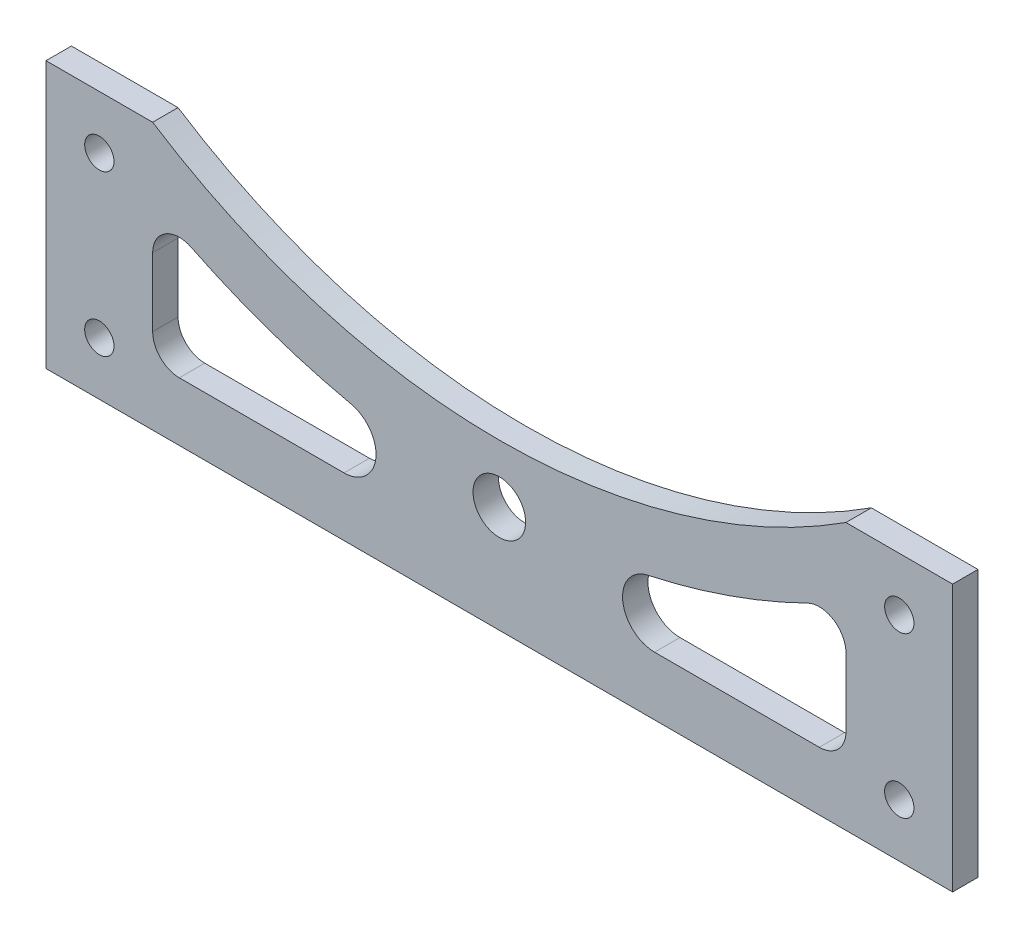
ISO-10303-21;
HEADER;
FILE_DESCRIPTION(('STEP AP214'),'2;1');
FILE_NAME('part.step','',(''),(''),'','','');
FILE_SCHEMA(('AUTOMOTIVE_DESIGN { 1 0 10303 214 1 1 1 1 }'));
ENDSEC;
DATA;
#1=APPLICATION_CONTEXT('core data for automotive mechanical design processes');
#2=APPLICATION_PROTOCOL_DEFINITION('international standard','automotive_design',2000,#1);
#3=PRODUCT_CONTEXT('',#1,'mechanical');
#4=PRODUCT('Part','Part','',(#3));
#5=PRODUCT_RELATED_PRODUCT_CATEGORY('part','',(#4));
#6=PRODUCT_DEFINITION_FORMATION('','',#4);
#7=PRODUCT_DEFINITION_CONTEXT('part definition',#1,'design');
#8=PRODUCT_DEFINITION('design','',#6,#7);
#9=PRODUCT_DEFINITION_SHAPE('','',#8);
#10=(LENGTH_UNIT() NAMED_UNIT(*) SI_UNIT(.MILLI.,.METRE.));
#11=(NAMED_UNIT(*) PLANE_ANGLE_UNIT() SI_UNIT($,.RADIAN.));
#12=(NAMED_UNIT(*) SI_UNIT($,.STERADIAN.) SOLID_ANGLE_UNIT());
#13=UNCERTAINTY_MEASURE_WITH_UNIT(LENGTH_MEASURE(1.E-05),#10,'distance_accuracy_value','');
#14=(GEOMETRIC_REPRESENTATION_CONTEXT(3) GLOBAL_UNCERTAINTY_ASSIGNED_CONTEXT((#13)) GLOBAL_UNIT_ASSIGNED_CONTEXT((#10,
#11,#12)) REPRESENTATION_CONTEXT('',''));
#15=CARTESIAN_POINT('',(0.,0.,0.));
#16=DIRECTION('',(0.,0.,1.));
#17=DIRECTION('',(1.,0.,0.));
#18=AXIS2_PLACEMENT_3D('',#15,#16,#17);
#19=CARTESIAN_POINT('',(0.,150.87120500916,4.7625));
#20=DIRECTION('',(0.,0.,1.));
#21=DIRECTION('',(1.,0.,0.));
#22=AXIS2_PLACEMENT_3D('',#19,#20,#21);
#23=PLANE('',#22);
#24=CARTESIAN_POINT('',(0.,150.87120500916,4.7625));
#25=DIRECTION('',(0.,0.,-1.));
#26=DIRECTION('',(1.,0.,0.));
#27=AXIS2_PLACEMENT_3D('',#24,#25,#26);
#28=CIRCLE('',#27,131.);
#29=CARTESIAN_POINT('',(-27.8368892894249,22.862972482153,4.7625));
#30=VERTEX_POINT('',#29);
#31=CARTESIAN_POINT('',(-57.7941176470588,33.309136443666,4.7625));
#32=VERTEX_POINT('',#31);
#33=EDGE_CURVE('E211',#30,#32,#28,.T.);
#34=ORIENTED_EDGE('',*,*,#33,.F.);
#35=CARTESIAN_POINT('',(-29.1118613179481,17.,4.7625));
#36=DIRECTION('',(0.,0.,1.));
#37=DIRECTION('',(1.,0.,0.));
#38=AXIS2_PLACEMENT_3D('',#35,#36,#37);
#39=CIRCLE('',#38,6.00000000000001);
#40=CARTESIAN_POINT('',(-29.1118613179481,11.,4.7625));
#41=VERTEX_POINT('',#40);
#42=EDGE_CURVE('E209',#41,#30,#39,.T.);
#43=ORIENTED_EDGE('',*,*,#42,.F.);
#44=DIRECTION('',(1.,0.,0.));
#45=VECTOR('',#44,1.);
#46=CARTESIAN_POINT('',(-60.,11.,4.7625));
#47=LINE('',#46,#45);
#48=CARTESIAN_POINT('',(-60.,11.,4.7625));
#49=VERTEX_POINT('',#48);
#50=EDGE_CURVE('E221',#49,#41,#47,.T.);
#51=ORIENTED_EDGE('',*,*,#50,.F.);
#52=CARTESIAN_POINT('',(-60.,16.,4.7625));
#53=DIRECTION('',(0.,0.,1.));
#54=DIRECTION('',(1.,0.,0.));
#55=AXIS2_PLACEMENT_3D('',#52,#53,#54);
#56=CIRCLE('',#55,5.);
#57=CARTESIAN_POINT('',(-65.,16.,4.7625));
#58=VERTEX_POINT('',#57);
#59=EDGE_CURVE('E218',#58,#49,#56,.T.);
#60=ORIENTED_EDGE('',*,*,#59,.F.);
#61=DIRECTION('',(0.,-1.,0.));
#62=VECTOR('',#61,1.);
#63=CARTESIAN_POINT('',(-65.,28.8220345900212,4.7625));
#64=LINE('',#63,#62);
#65=CARTESIAN_POINT('',(-65.,28.8220345900212,4.7625));
#66=VERTEX_POINT('',#65);
#67=EDGE_CURVE('E216',#66,#58,#64,.T.);
#68=ORIENTED_EDGE('',*,*,#67,.F.);
#69=CARTESIAN_POINT('',(-60.,28.8220345900212,4.7625));
#70=DIRECTION('',(0.,0.,1.));
#71=DIRECTION('',(1.,0.,0.));
#72=AXIS2_PLACEMENT_3D('',#69,#70,#71);
#73=CIRCLE('',#72,5.);
#74=EDGE_CURVE('E214',#32,#66,#73,.T.);
#75=ORIENTED_EDGE('',*,*,#74,.F.);
#76=EDGE_LOOP('',(#34,#43,#51,#60,#68,#75));
#77=FACE_BOUND('',#76,.T.);
#78=CARTESIAN_POINT('',(75.,40.,4.7625));
#79=DIRECTION('',(0.,0.,1.));
#80=DIRECTION('',(1.,0.,0.));
#81=AXIS2_PLACEMENT_3D('',#78,#79,#80);
#82=CIRCLE('',#81,2.75000000000001);
#83=CARTESIAN_POINT('',(77.75,40.,4.7625));
#84=VERTEX_POINT('',#83);
#85=EDGE_CURVE('E260',#84,#84,#82,.T.);
#86=ORIENTED_EDGE('',*,*,#85,.F.);
#87=EDGE_LOOP('',(#86));
#88=FACE_BOUND('',#87,.T.);
#89=CARTESIAN_POINT('',(-75.,40.,4.7625));
#90=DIRECTION('',(0.,0.,1.));
#91=DIRECTION('',(1.,0.,0.));
#92=AXIS2_PLACEMENT_3D('',#89,#90,#91);
#93=CIRCLE('',#92,2.75000000000001);
#94=CARTESIAN_POINT('',(-72.25,40.,4.7625));
#95=VERTEX_POINT('',#94);
#96=EDGE_CURVE('E272',#95,#95,#93,.T.);
#97=ORIENTED_EDGE('',*,*,#96,.F.);
#98=EDGE_LOOP('',(#97));
#99=FACE_BOUND('',#98,.T.);
#100=DIRECTION('',(0.,-1.,0.));
#101=VECTOR('',#100,1.);
#102=CARTESIAN_POINT('',(-85.,0.,4.7625));
#103=LINE('',#102,#101);
#104=CARTESIAN_POINT('',(-85.,50.,4.7625));
#105=VERTEX_POINT('',#104);
#106=CARTESIAN_POINT('',(-85.,0.,4.7625));
#107=VERTEX_POINT('',#106);
#108=EDGE_CURVE('E284',#105,#107,#103,.T.);
#109=ORIENTED_EDGE('',*,*,#108,.T.);
#110=DIRECTION('',(1.,0.,0.));
#111=VECTOR('',#110,1.);
#112=CARTESIAN_POINT('',(-85.,0.,4.7625));
#113=LINE('',#112,#111);
#114=CARTESIAN_POINT('',(85.,0.,4.7625));
#115=VERTEX_POINT('',#114);
#116=EDGE_CURVE('E287',#107,#115,#113,.T.);
#117=ORIENTED_EDGE('',*,*,#116,.T.);
#118=DIRECTION('',(0.,1.,0.));
#119=VECTOR('',#118,1.);
#120=CARTESIAN_POINT('',(85.,0.,4.7625));
#121=LINE('',#120,#119);
#122=CARTESIAN_POINT('',(85.,50.,4.7625));
#123=VERTEX_POINT('',#122);
#124=EDGE_CURVE('E290',#115,#123,#121,.T.);
#125=ORIENTED_EDGE('',*,*,#124,.T.);
#126=DIRECTION('',(-1.,0.,0.));
#127=VECTOR('',#126,1.);
#128=CARTESIAN_POINT('',(85.,50.,4.7625));
#129=LINE('',#128,#127);
#130=CARTESIAN_POINT('',(65.,50.,4.7625));
#131=VERTEX_POINT('',#130);
#132=EDGE_CURVE('E292',#123,#131,#129,.T.);
#133=ORIENTED_EDGE('',*,*,#132,.T.);
#134=CARTESIAN_POINT('',(0.,150.87120500916,4.7625));
#135=DIRECTION('',(0.,0.,-1.));
#136=DIRECTION('',(1.,0.,0.));
#137=AXIS2_PLACEMENT_3D('',#134,#135,#136);
#138=CIRCLE('',#137,120.);
#139=CARTESIAN_POINT('',(-65.,50.,4.7625));
#140=VERTEX_POINT('',#139);
#141=EDGE_CURVE('E294',#131,#140,#138,.T.);
#142=ORIENTED_EDGE('',*,*,#141,.T.);
#143=DIRECTION('',(-1.,0.,0.));
#144=VECTOR('',#143,1.);
#145=CARTESIAN_POINT('',(-85.,50.,4.7625));
#146=LINE('',#145,#144);
#147=EDGE_CURVE('E296',#140,#105,#146,.T.);
#148=ORIENTED_EDGE('',*,*,#147,.T.);
#149=EDGE_LOOP('',(#109,#117,#125,#133,#142,#148));
#150=FACE_BOUND('',#149,.T.);
#151=CARTESIAN_POINT('',(0.,20.,4.7625));
#152=DIRECTION('',(0.,0.,1.));
#153=DIRECTION('',(1.,0.,0.));
#154=AXIS2_PLACEMENT_3D('',#151,#152,#153);
#155=CIRCLE('',#154,4.93);
#156=CARTESIAN_POINT('',(4.93,20.,4.7625));
#157=VERTEX_POINT('',#156);
#158=EDGE_CURVE('E278',#157,#157,#155,.T.);
#159=ORIENTED_EDGE('',*,*,#158,.F.);
#160=EDGE_LOOP('',(#159));
#161=FACE_BOUND('',#160,.T.);
#162=CARTESIAN_POINT('',(-75.,10.,4.7625));
#163=DIRECTION('',(0.,0.,1.));
#164=DIRECTION('',(1.,0.,0.));
#165=AXIS2_PLACEMENT_3D('',#162,#163,#164);
#166=CIRCLE('',#165,2.75000000000001);
#167=CARTESIAN_POINT('',(-72.25,10.,4.7625));
#168=VERTEX_POINT('',#167);
#169=EDGE_CURVE('E266',#168,#168,#166,.T.);
#170=ORIENTED_EDGE('',*,*,#169,.F.);
#171=EDGE_LOOP('',(#170));
#172=FACE_BOUND('',#171,.T.);
#173=CARTESIAN_POINT('',(75.,10.,4.7625));
#174=DIRECTION('',(0.,0.,1.));
#175=DIRECTION('',(1.,0.,0.));
#176=AXIS2_PLACEMENT_3D('',#173,#174,#175);
#177=CIRCLE('',#176,2.75000000000001);
#178=CARTESIAN_POINT('',(77.75,10.,4.7625));
#179=VERTEX_POINT('',#178);
#180=EDGE_CURVE('E254',#179,#179,#177,.T.);
#181=ORIENTED_EDGE('',*,*,#180,.F.);
#182=EDGE_LOOP('',(#181));
#183=FACE_BOUND('',#182,.T.);
#184=DIRECTION('',(1.,0.,0.));
#185=VECTOR('',#184,1.);
#186=CARTESIAN_POINT('',(60.,11.,4.7625));
#187=LINE('',#186,#185);
#188=CARTESIAN_POINT('',(29.1118613179481,11.,4.7625));
#189=VERTEX_POINT('',#188);
#190=CARTESIAN_POINT('',(60.,11.,4.7625));
#191=VERTEX_POINT('',#190);
#192=EDGE_CURVE('E166',#189,#191,#187,.T.);
#193=ORIENTED_EDGE('',*,*,#192,.F.);
#194=CARTESIAN_POINT('',(29.1118613179481,17.,4.7625));
#195=DIRECTION('',(0.,0.,1.));
#196=DIRECTION('',(1.,0.,0.));
#197=AXIS2_PLACEMENT_3D('',#194,#195,#196);
#198=CIRCLE('',#197,6.00000000000001);
#199=CARTESIAN_POINT('',(27.8368892894249,22.862972482153,4.7625));
#200=VERTEX_POINT('',#199);
#201=EDGE_CURVE('E158',#200,#189,#198,.T.);
#202=ORIENTED_EDGE('',*,*,#201,.F.);
#203=CARTESIAN_POINT('',(0.,150.87120500916,4.7625));
#204=DIRECTION('',(0.,0.,-1.));
#205=DIRECTION('',(1.,0.,0.));
#206=AXIS2_PLACEMENT_3D('',#203,#204,#205);
#207=CIRCLE('',#206,131.);
#208=CARTESIAN_POINT('',(57.7941176470588,33.309136443666,4.7625));
#209=VERTEX_POINT('',#208);
#210=EDGE_CURVE('E187',#209,#200,#207,.T.);
#211=ORIENTED_EDGE('',*,*,#210,.F.);
#212=CARTESIAN_POINT('',(60.,28.8220345900212,4.7625));
#213=DIRECTION('',(0.,0.,1.));
#214=DIRECTION('',(1.,0.,0.));
#215=AXIS2_PLACEMENT_3D('',#212,#213,#214);
#216=CIRCLE('',#215,5.);
#217=CARTESIAN_POINT('',(65.,28.8220345900212,4.7625));
#218=VERTEX_POINT('',#217);
#219=EDGE_CURVE('E185',#218,#209,#216,.T.);
#220=ORIENTED_EDGE('',*,*,#219,.F.);
#221=DIRECTION('',(0.,1.,0.));
#222=VECTOR('',#221,1.);
#223=CARTESIAN_POINT('',(65.,28.8220345900212,4.7625));
#224=LINE('',#223,#222);
#225=CARTESIAN_POINT('',(65.,16.,4.7625));
#226=VERTEX_POINT('',#225);
#227=EDGE_CURVE('E181',#226,#218,#224,.T.);
#228=ORIENTED_EDGE('',*,*,#227,.F.);
#229=CARTESIAN_POINT('',(60.,16.,4.7625));
#230=DIRECTION('',(0.,0.,1.));
#231=DIRECTION('',(-1.,0.,0.));
#232=AXIS2_PLACEMENT_3D('',#229,#230,#231);
#233=CIRCLE('',#232,4.99999999999999);
#234=EDGE_CURVE('E179',#191,#226,#233,.T.);
#235=ORIENTED_EDGE('',*,*,#234,.F.);
#236=EDGE_LOOP('',(#193,#202,#211,#220,#228,#235));
#237=FACE_BOUND('',#236,.T.);
#238=ADVANCED_FACE('F33',(#77,#88,#99,#150,#161,#172,#183,#237),#23,.T.);
#239=CARTESIAN_POINT('',(0.,150.87120500916,0.));
#240=DIRECTION('',(0.,0.,1.));
#241=DIRECTION('',(1.,0.,0.));
#242=AXIS2_PLACEMENT_3D('',#239,#240,#241);
#243=PLANE('',#242);
#244=CARTESIAN_POINT('',(-29.1118613179481,17.,0.));
#245=DIRECTION('',(0.,0.,1.));
#246=DIRECTION('',(1.,0.,0.));
#247=AXIS2_PLACEMENT_3D('',#244,#245,#246);
#248=CIRCLE('',#247,6.00000000000001);
#249=CARTESIAN_POINT('',(-29.1118613179481,11.,0.));
#250=VERTEX_POINT('',#249);
#251=CARTESIAN_POINT('',(-27.8368892894249,22.862972482153,0.));
#252=VERTEX_POINT('',#251);
#253=EDGE_CURVE('E174',#250,#252,#248,.T.);
#254=ORIENTED_EDGE('',*,*,#253,.T.);
#255=CARTESIAN_POINT('',(0.,150.87120500916,0.));
#256=DIRECTION('',(0.,0.,-1.));
#257=DIRECTION('',(1.,0.,0.));
#258=AXIS2_PLACEMENT_3D('',#255,#256,#257);
#259=CIRCLE('',#258,131.);
#260=CARTESIAN_POINT('',(-57.7941176470588,33.309136443666,0.));
#261=VERTEX_POINT('',#260);
#262=EDGE_CURVE('E226',#252,#261,#259,.T.);
#263=ORIENTED_EDGE('',*,*,#262,.T.);
#264=CARTESIAN_POINT('',(-60.,28.8220345900212,0.));
#265=DIRECTION('',(0.,0.,1.));
#266=DIRECTION('',(1.,0.,0.));
#267=AXIS2_PLACEMENT_3D('',#264,#265,#266);
#268=CIRCLE('',#267,5.);
#269=CARTESIAN_POINT('',(-65.,28.8220345900212,0.));
#270=VERTEX_POINT('',#269);
#271=EDGE_CURVE('E229',#261,#270,#268,.T.);
#272=ORIENTED_EDGE('',*,*,#271,.T.);
#273=DIRECTION('',(0.,-1.,0.));
#274=VECTOR('',#273,1.);
#275=CARTESIAN_POINT('',(-65.,28.8220345900212,0.));
#276=LINE('',#275,#274);
#277=CARTESIAN_POINT('',(-65.,16.,0.));
#278=VERTEX_POINT('',#277);
#279=EDGE_CURVE('E232',#270,#278,#276,.T.);
#280=ORIENTED_EDGE('',*,*,#279,.T.);
#281=CARTESIAN_POINT('',(-60.,16.,0.));
#282=DIRECTION('',(0.,0.,1.));
#283=DIRECTION('',(1.,0.,0.));
#284=AXIS2_PLACEMENT_3D('',#281,#282,#283);
#285=CIRCLE('',#284,5.);
#286=CARTESIAN_POINT('',(-60.,11.,0.));
#287=VERTEX_POINT('',#286);
#288=EDGE_CURVE('E235',#278,#287,#285,.T.);
#289=ORIENTED_EDGE('',*,*,#288,.T.);
#290=DIRECTION('',(1.,0.,0.));
#291=VECTOR('',#290,1.);
#292=CARTESIAN_POINT('',(-60.,11.,0.));
#293=LINE('',#292,#291);
#294=EDGE_CURVE('E212',#287,#250,#293,.T.);
#295=ORIENTED_EDGE('',*,*,#294,.T.);
#296=EDGE_LOOP('',(#254,#263,#272,#280,#289,#295));
#297=FACE_BOUND('',#296,.T.);
#298=CARTESIAN_POINT('',(75.,40.,0.));
#299=DIRECTION('',(0.,0.,1.));
#300=DIRECTION('',(1.,0.,0.));
#301=AXIS2_PLACEMENT_3D('',#298,#299,#300);
#302=CIRCLE('',#301,2.75000000000001);
#303=CARTESIAN_POINT('',(77.75,40.,0.));
#304=VERTEX_POINT('',#303);
#305=EDGE_CURVE('E257',#304,#304,#302,.T.);
#306=ORIENTED_EDGE('',*,*,#305,.T.);
#307=EDGE_LOOP('',(#306));
#308=FACE_BOUND('',#307,.T.);
#309=CARTESIAN_POINT('',(-75.,40.,0.));
#310=DIRECTION('',(0.,0.,1.));
#311=DIRECTION('',(1.,0.,0.));
#312=AXIS2_PLACEMENT_3D('',#309,#310,#311);
#313=CIRCLE('',#312,2.75000000000001);
#314=CARTESIAN_POINT('',(-72.25,40.,0.));
#315=VERTEX_POINT('',#314);
#316=EDGE_CURVE('E269',#315,#315,#313,.T.);
#317=ORIENTED_EDGE('',*,*,#316,.T.);
#318=EDGE_LOOP('',(#317));
#319=FACE_BOUND('',#318,.T.);
#320=DIRECTION('',(0.,-1.,0.));
#321=VECTOR('',#320,1.);
#322=CARTESIAN_POINT('',(-85.,0.,0.));
#323=LINE('',#322,#321);
#324=CARTESIAN_POINT('',(-85.,50.,0.));
#325=VERTEX_POINT('',#324);
#326=CARTESIAN_POINT('',(-85.,0.,0.));
#327=VERTEX_POINT('',#326);
#328=EDGE_CURVE('E281',#325,#327,#323,.T.);
#329=ORIENTED_EDGE('',*,*,#328,.F.);
#330=DIRECTION('',(-1.,0.,0.));
#331=VECTOR('',#330,1.);
#332=CARTESIAN_POINT('',(-85.,50.,0.));
#333=LINE('',#332,#331);
#334=CARTESIAN_POINT('',(-65.,50.,0.));
#335=VERTEX_POINT('',#334);
#336=EDGE_CURVE('E288',#335,#325,#333,.T.);
#337=ORIENTED_EDGE('',*,*,#336,.F.);
#338=CARTESIAN_POINT('',(0.,150.87120500916,0.));
#339=DIRECTION('',(0.,0.,-1.));
#340=DIRECTION('',(1.,0.,0.));
#341=AXIS2_PLACEMENT_3D('',#338,#339,#340);
#342=CIRCLE('',#341,120.);
#343=CARTESIAN_POINT('',(65.,50.,0.));
#344=VERTEX_POINT('',#343);
#345=EDGE_CURVE('E307',#344,#335,#342,.T.);
#346=ORIENTED_EDGE('',*,*,#345,.F.);
#347=DIRECTION('',(-1.,0.,0.));
#348=VECTOR('',#347,1.);
#349=CARTESIAN_POINT('',(85.,50.,0.));
#350=LINE('',#349,#348);
#351=CARTESIAN_POINT('',(85.,50.,0.));
#352=VERTEX_POINT('',#351);
#353=EDGE_CURVE('E305',#352,#344,#350,.T.);
#354=ORIENTED_EDGE('',*,*,#353,.F.);
#355=DIRECTION('',(0.,1.,0.));
#356=VECTOR('',#355,1.);
#357=CARTESIAN_POINT('',(85.,0.,0.));
#358=LINE('',#357,#356);
#359=CARTESIAN_POINT('',(85.,0.,0.));
#360=VERTEX_POINT('',#359);
#361=EDGE_CURVE('E303',#360,#352,#358,.T.);
#362=ORIENTED_EDGE('',*,*,#361,.F.);
#363=DIRECTION('',(1.,0.,0.));
#364=VECTOR('',#363,1.);
#365=CARTESIAN_POINT('',(-85.,0.,0.));
#366=LINE('',#365,#364);
#367=EDGE_CURVE('E301',#327,#360,#366,.T.);
#368=ORIENTED_EDGE('',*,*,#367,.F.);
#369=EDGE_LOOP('',(#329,#337,#346,#354,#362,#368));
#370=FACE_BOUND('',#369,.T.);
#371=CARTESIAN_POINT('',(0.,20.,0.));
#372=DIRECTION('',(0.,0.,1.));
#373=DIRECTION('',(1.,0.,0.));
#374=AXIS2_PLACEMENT_3D('',#371,#372,#373);
#375=CIRCLE('',#374,4.93);
#376=CARTESIAN_POINT('',(4.93,20.,0.));
#377=VERTEX_POINT('',#376);
#378=EDGE_CURVE('E275',#377,#377,#375,.T.);
#379=ORIENTED_EDGE('',*,*,#378,.T.);
#380=EDGE_LOOP('',(#379));
#381=FACE_BOUND('',#380,.T.);
#382=CARTESIAN_POINT('',(-75.,10.,0.));
#383=DIRECTION('',(0.,0.,1.));
#384=DIRECTION('',(1.,0.,0.));
#385=AXIS2_PLACEMENT_3D('',#382,#383,#384);
#386=CIRCLE('',#385,2.75000000000001);
#387=CARTESIAN_POINT('',(-72.25,10.,0.));
#388=VERTEX_POINT('',#387);
#389=EDGE_CURVE('E263',#388,#388,#386,.T.);
#390=ORIENTED_EDGE('',*,*,#389,.T.);
#391=EDGE_LOOP('',(#390));
#392=FACE_BOUND('',#391,.T.);
#393=CARTESIAN_POINT('',(75.,10.,0.));
#394=DIRECTION('',(0.,0.,1.));
#395=DIRECTION('',(1.,0.,0.));
#396=AXIS2_PLACEMENT_3D('',#393,#394,#395);
#397=CIRCLE('',#396,2.75000000000001);
#398=CARTESIAN_POINT('',(77.75,10.,0.));
#399=VERTEX_POINT('',#398);
#400=EDGE_CURVE('E253',#399,#399,#397,.T.);
#401=ORIENTED_EDGE('',*,*,#400,.T.);
#402=EDGE_LOOP('',(#401));
#403=FACE_BOUND('',#402,.T.);
#404=CARTESIAN_POINT('',(29.1118613179481,17.,0.));
#405=DIRECTION('',(0.,0.,1.));
#406=DIRECTION('',(1.,0.,0.));
#407=AXIS2_PLACEMENT_3D('',#404,#405,#406);
#408=CIRCLE('',#407,6.00000000000001);
#409=CARTESIAN_POINT('',(27.8368892894249,22.862972482153,0.));
#410=VERTEX_POINT('',#409);
#411=CARTESIAN_POINT('',(29.1118613179481,11.,0.));
#412=VERTEX_POINT('',#411);
#413=EDGE_CURVE('E56',#410,#412,#408,.T.);
#414=ORIENTED_EDGE('',*,*,#413,.T.);
#415=DIRECTION('',(1.,0.,0.));
#416=VECTOR('',#415,1.);
#417=CARTESIAN_POINT('',(60.,11.,0.));
#418=LINE('',#417,#416);
#419=CARTESIAN_POINT('',(60.,11.,0.));
#420=VERTEX_POINT('',#419);
#421=EDGE_CURVE('E173',#412,#420,#418,.T.);
#422=ORIENTED_EDGE('',*,*,#421,.T.);
#423=CARTESIAN_POINT('',(60.,16.,0.));
#424=DIRECTION('',(0.,0.,1.));
#425=DIRECTION('',(-1.,0.,0.));
#426=AXIS2_PLACEMENT_3D('',#423,#424,#425);
#427=CIRCLE('',#426,4.99999999999999);
#428=CARTESIAN_POINT('',(65.,16.,0.));
#429=VERTEX_POINT('',#428);
#430=EDGE_CURVE('E191',#420,#429,#427,.T.);
#431=ORIENTED_EDGE('',*,*,#430,.T.);
#432=DIRECTION('',(0.,1.,0.));
#433=VECTOR('',#432,1.);
#434=CARTESIAN_POINT('',(65.,28.8220345900212,0.));
#435=LINE('',#434,#433);
#436=CARTESIAN_POINT('',(65.,28.8220345900212,0.));
#437=VERTEX_POINT('',#436);
#438=EDGE_CURVE('E194',#429,#437,#435,.T.);
#439=ORIENTED_EDGE('',*,*,#438,.T.);
#440=CARTESIAN_POINT('',(60.,28.8220345900212,0.));
#441=DIRECTION('',(0.,0.,1.));
#442=DIRECTION('',(1.,0.,0.));
#443=AXIS2_PLACEMENT_3D('',#440,#441,#442);
#444=CIRCLE('',#443,5.);
#445=CARTESIAN_POINT('',(57.7941176470588,33.309136443666,0.));
#446=VERTEX_POINT('',#445);
#447=EDGE_CURVE('E197',#437,#446,#444,.T.);
#448=ORIENTED_EDGE('',*,*,#447,.T.);
#449=CARTESIAN_POINT('',(0.,150.87120500916,0.));
#450=DIRECTION('',(0.,0.,-1.));
#451=DIRECTION('',(1.,0.,0.));
#452=AXIS2_PLACEMENT_3D('',#449,#450,#451);
#453=CIRCLE('',#452,131.);
#454=EDGE_CURVE('E167',#446,#410,#453,.T.);
#455=ORIENTED_EDGE('',*,*,#454,.T.);
#456=EDGE_LOOP('',(#414,#422,#431,#439,#448,#455));
#457=FACE_BOUND('',#456,.T.);
#458=ADVANCED_FACE('F331',(#297,#308,#319,#370,#381,#392,#403,#457),#243,.F.);
#459=CARTESIAN_POINT('',(-85.,0.,4.7625));
#460=DIRECTION('',(1.,0.,0.));
#461=DIRECTION('',(0.,0.,-1.));
#462=AXIS2_PLACEMENT_3D('',#459,#460,#461);
#463=PLANE('',#462);
#464=ORIENTED_EDGE('',*,*,#328,.T.);
#465=DIRECTION('',(0.,0.,-1.));
#466=VECTOR('',#465,1.);
#467=CARTESIAN_POINT('',(-85.,0.,4.7625));
#468=LINE('',#467,#466);
#469=EDGE_CURVE('E11',#107,#327,#468,.T.);
#470=ORIENTED_EDGE('',*,*,#469,.F.);
#471=ORIENTED_EDGE('',*,*,#108,.F.);
#472=DIRECTION('',(0.,0.,-1.));
#473=VECTOR('',#472,1.);
#474=CARTESIAN_POINT('',(-85.,50.,4.7625));
#475=LINE('',#474,#473);
#476=EDGE_CURVE('E298',#105,#325,#475,.T.);
#477=ORIENTED_EDGE('',*,*,#476,.T.);
#478=EDGE_LOOP('',(#464,#470,#471,#477));
#479=FACE_BOUND('',#478,.T.);
#480=ADVANCED_FACE('F35',(#479),#463,.F.);
#481=CARTESIAN_POINT('',(-85.,0.,4.7625));
#482=DIRECTION('',(0.,1.,0.));
#483=DIRECTION('',(0.,0.,1.));
#484=AXIS2_PLACEMENT_3D('',#481,#482,#483);
#485=PLANE('',#484);
#486=ORIENTED_EDGE('',*,*,#367,.T.);
#487=DIRECTION('',(0.,0.,-1.));
#488=VECTOR('',#487,1.);
#489=CARTESIAN_POINT('',(85.,0.,4.7625));
#490=LINE('',#489,#488);
#491=EDGE_CURVE('E41',#115,#360,#490,.T.);
#492=ORIENTED_EDGE('',*,*,#491,.F.);
#493=ORIENTED_EDGE('',*,*,#116,.F.);
#494=ORIENTED_EDGE('',*,*,#469,.T.);
#495=EDGE_LOOP('',(#486,#492,#493,#494));
#496=FACE_BOUND('',#495,.T.);
#497=ADVANCED_FACE('F349',(#496),#485,.F.);
#498=CARTESIAN_POINT('',(85.,0.,4.7625));
#499=DIRECTION('',(-1.,0.,0.));
#500=DIRECTION('',(0.,0.,1.));
#501=AXIS2_PLACEMENT_3D('',#498,#499,#500);
#502=PLANE('',#501);
#503=ORIENTED_EDGE('',*,*,#361,.T.);
#504=DIRECTION('',(0.,0.,-1.));
#505=VECTOR('',#504,1.);
#506=CARTESIAN_POINT('',(85.,50.,4.7625));
#507=LINE('',#506,#505);
#508=EDGE_CURVE('E318',#123,#352,#507,.T.);
#509=ORIENTED_EDGE('',*,*,#508,.F.);
#510=ORIENTED_EDGE('',*,*,#124,.F.);
#511=ORIENTED_EDGE('',*,*,#491,.T.);
#512=EDGE_LOOP('',(#503,#509,#510,#511));
#513=FACE_BOUND('',#512,.T.);
#514=ADVANCED_FACE('F325',(#513),#502,.F.);
#515=CARTESIAN_POINT('',(85.,50.,4.7625));
#516=DIRECTION('',(0.,-1.,0.));
#517=DIRECTION('',(0.,0.,-1.));
#518=AXIS2_PLACEMENT_3D('',#515,#516,#517);
#519=PLANE('',#518);
#520=ORIENTED_EDGE('',*,*,#353,.T.);
#521=DIRECTION('',(0.,0.,-1.));
#522=VECTOR('',#521,1.);
#523=CARTESIAN_POINT('',(65.,50.,4.7625));
#524=LINE('',#523,#522);
#525=EDGE_CURVE('E315',#131,#344,#524,.T.);
#526=ORIENTED_EDGE('',*,*,#525,.F.);
#527=ORIENTED_EDGE('',*,*,#132,.F.);
#528=ORIENTED_EDGE('',*,*,#508,.T.);
#529=EDGE_LOOP('',(#520,#526,#527,#528));
#530=FACE_BOUND('',#529,.T.);
#531=ADVANCED_FACE('F337',(#530),#519,.F.);
#532=CARTESIAN_POINT('',(0.,150.87120500916,4.7625));
#533=DIRECTION('',(0.,0.,-1.));
#534=DIRECTION('',(-1.,0.,0.));
#535=AXIS2_PLACEMENT_3D('',#532,#533,#534);
#536=CYLINDRICAL_SURFACE('',#535,120.);
#537=ORIENTED_EDGE('',*,*,#345,.T.);
#538=DIRECTION('',(0.,0.,-1.));
#539=VECTOR('',#538,1.);
#540=CARTESIAN_POINT('',(-65.,50.,4.7625));
#541=LINE('',#540,#539);
#542=EDGE_CURVE('E312',#140,#335,#541,.T.);
#543=ORIENTED_EDGE('',*,*,#542,.F.);
#544=ORIENTED_EDGE('',*,*,#141,.F.);
#545=ORIENTED_EDGE('',*,*,#525,.T.);
#546=EDGE_LOOP('',(#537,#543,#544,#545));
#547=FACE_BOUND('',#546,.T.);
#548=ADVANCED_FACE('F341',(#547),#536,.F.);
#549=CARTESIAN_POINT('',(-85.,50.,4.7625));
#550=DIRECTION('',(0.,-1.,0.));
#551=DIRECTION('',(0.,0.,-1.));
#552=AXIS2_PLACEMENT_3D('',#549,#550,#551);
#553=PLANE('',#552);
#554=ORIENTED_EDGE('',*,*,#336,.T.);
#555=ORIENTED_EDGE('',*,*,#476,.F.);
#556=ORIENTED_EDGE('',*,*,#147,.F.);
#557=ORIENTED_EDGE('',*,*,#542,.T.);
#558=EDGE_LOOP('',(#554,#555,#556,#557));
#559=FACE_BOUND('',#558,.T.);
#560=ADVANCED_FACE('F352',(#559),#553,.F.);
#561=CARTESIAN_POINT('',(0.,20.,4.7625));
#562=DIRECTION('',(0.,0.,-1.));
#563=DIRECTION('',(-1.,0.,0.));
#564=AXIS2_PLACEMENT_3D('',#561,#562,#563);
#565=CYLINDRICAL_SURFACE('',#564,4.93);
#566=ORIENTED_EDGE('',*,*,#158,.T.);
#567=EDGE_LOOP('',(#566));
#568=FACE_BOUND('',#567,.T.);
#569=ORIENTED_EDGE('',*,*,#378,.F.);
#570=EDGE_LOOP('',(#569));
#571=FACE_BOUND('',#570,.T.);
#572=ADVANCED_FACE('F354',(#568,#571),#565,.F.);
#573=CARTESIAN_POINT('',(-75.,40.,4.7625));
#574=DIRECTION('',(0.,0.,-1.));
#575=DIRECTION('',(-1.,0.,0.));
#576=AXIS2_PLACEMENT_3D('',#573,#574,#575);
#577=CYLINDRICAL_SURFACE('',#576,2.75000000000001);
#578=ORIENTED_EDGE('',*,*,#96,.T.);
#579=EDGE_LOOP('',(#578));
#580=FACE_BOUND('',#579,.T.);
#581=ORIENTED_EDGE('',*,*,#316,.F.);
#582=EDGE_LOOP('',(#581));
#583=FACE_BOUND('',#582,.T.);
#584=ADVANCED_FACE('F360',(#580,#583),#577,.F.);
#585=CARTESIAN_POINT('',(-75.,10.,4.7625));
#586=DIRECTION('',(0.,0.,-1.));
#587=DIRECTION('',(-1.,0.,0.));
#588=AXIS2_PLACEMENT_3D('',#585,#586,#587);
#589=CYLINDRICAL_SURFACE('',#588,2.75000000000001);
#590=ORIENTED_EDGE('',*,*,#169,.T.);
#591=EDGE_LOOP('',(#590));
#592=FACE_BOUND('',#591,.T.);
#593=ORIENTED_EDGE('',*,*,#389,.F.);
#594=EDGE_LOOP('',(#593));
#595=FACE_BOUND('',#594,.T.);
#596=ADVANCED_FACE('F377',(#592,#595),#589,.F.);
#597=CARTESIAN_POINT('',(75.,40.,4.7625));
#598=DIRECTION('',(0.,0.,-1.));
#599=DIRECTION('',(-1.,0.,0.));
#600=AXIS2_PLACEMENT_3D('',#597,#598,#599);
#601=CYLINDRICAL_SURFACE('',#600,2.75000000000001);
#602=ORIENTED_EDGE('',*,*,#85,.T.);
#603=EDGE_LOOP('',(#602));
#604=FACE_BOUND('',#603,.T.);
#605=ORIENTED_EDGE('',*,*,#305,.F.);
#606=EDGE_LOOP('',(#605));
#607=FACE_BOUND('',#606,.T.);
#608=ADVANCED_FACE('F381',(#604,#607),#601,.F.);
#609=CARTESIAN_POINT('',(75.,10.,4.7625));
#610=DIRECTION('',(0.,0.,-1.));
#611=DIRECTION('',(-1.,0.,0.));
#612=AXIS2_PLACEMENT_3D('',#609,#610,#611);
#613=CYLINDRICAL_SURFACE('',#612,2.75000000000001);
#614=ORIENTED_EDGE('',*,*,#180,.T.);
#615=EDGE_LOOP('',(#614));
#616=FACE_BOUND('',#615,.T.);
#617=ORIENTED_EDGE('',*,*,#400,.F.);
#618=EDGE_LOOP('',(#617));
#619=FACE_BOUND('',#618,.T.);
#620=ADVANCED_FACE('F385',(#616,#619),#613,.F.);
#621=CARTESIAN_POINT('',(-29.1118613179481,17.,4.7625));
#622=DIRECTION('',(0.,0.,-1.));
#623=DIRECTION('',(-1.,0.,0.));
#624=AXIS2_PLACEMENT_3D('',#621,#622,#623);
#625=CYLINDRICAL_SURFACE('',#624,6.00000000000001);
#626=ORIENTED_EDGE('',*,*,#253,.F.);
#627=DIRECTION('',(0.,0.,-1.));
#628=VECTOR('',#627,1.);
#629=CARTESIAN_POINT('',(-29.1118613179481,11.,4.7625));
#630=LINE('',#629,#628);
#631=EDGE_CURVE('E223',#41,#250,#630,.T.);
#632=ORIENTED_EDGE('',*,*,#631,.F.);
#633=ORIENTED_EDGE('',*,*,#42,.T.);
#634=DIRECTION('',(0.,0.,-1.));
#635=VECTOR('',#634,1.);
#636=CARTESIAN_POINT('',(-27.8368892894249,22.862972482153,4.7625));
#637=LINE('',#636,#635);
#638=EDGE_CURVE('E250',#30,#252,#637,.T.);
#639=ORIENTED_EDGE('',*,*,#638,.T.);
#640=EDGE_LOOP('',(#626,#632,#633,#639));
#641=FACE_BOUND('',#640,.T.);
#642=ADVANCED_FACE('F389',(#641),#625,.F.);
#643=CARTESIAN_POINT('',(0.,150.87120500916,4.7625));
#644=DIRECTION('',(0.,0.,-1.));
#645=DIRECTION('',(-1.,0.,0.));
#646=AXIS2_PLACEMENT_3D('',#643,#644,#645);
#647=CYLINDRICAL_SURFACE('',#646,131.);
#648=ORIENTED_EDGE('',*,*,#262,.F.);
#649=ORIENTED_EDGE('',*,*,#638,.F.);
#650=ORIENTED_EDGE('',*,*,#33,.T.);
#651=DIRECTION('',(0.,0.,-1.));
#652=VECTOR('',#651,1.);
#653=CARTESIAN_POINT('',(-57.7941176470588,33.309136443666,4.7625));
#654=LINE('',#653,#652);
#655=EDGE_CURVE('E248',#32,#261,#654,.T.);
#656=ORIENTED_EDGE('',*,*,#655,.T.);
#657=EDGE_LOOP('',(#648,#649,#650,#656));
#658=FACE_BOUND('',#657,.T.);
#659=ADVANCED_FACE('F393',(#658),#647,.T.);
#660=CARTESIAN_POINT('',(-60.,28.8220345900212,4.7625));
#661=DIRECTION('',(0.,0.,-1.));
#662=DIRECTION('',(-1.,0.,0.));
#663=AXIS2_PLACEMENT_3D('',#660,#661,#662);
#664=CYLINDRICAL_SURFACE('',#663,5.);
#665=ORIENTED_EDGE('',*,*,#271,.F.);
#666=ORIENTED_EDGE('',*,*,#655,.F.);
#667=ORIENTED_EDGE('',*,*,#74,.T.);
#668=DIRECTION('',(0.,0.,-1.));
#669=VECTOR('',#668,1.);
#670=CARTESIAN_POINT('',(-65.,28.8220345900212,4.7625));
#671=LINE('',#670,#669);
#672=EDGE_CURVE('E246',#66,#270,#671,.T.);
#673=ORIENTED_EDGE('',*,*,#672,.T.);
#674=EDGE_LOOP('',(#665,#666,#667,#673));
#675=FACE_BOUND('',#674,.T.);
#676=ADVANCED_FACE('F397',(#675),#664,.F.);
#677=CARTESIAN_POINT('',(-65.,28.8220345900212,4.7625));
#678=DIRECTION('',(1.,0.,0.));
#679=DIRECTION('',(0.,1.,0.));
#680=AXIS2_PLACEMENT_3D('',#677,#678,#679);
#681=PLANE('',#680);
#682=ORIENTED_EDGE('',*,*,#279,.F.);
#683=ORIENTED_EDGE('',*,*,#672,.F.);
#684=ORIENTED_EDGE('',*,*,#67,.T.);
#685=DIRECTION('',(0.,0.,-1.));
#686=VECTOR('',#685,1.);
#687=CARTESIAN_POINT('',(-65.,16.,4.7625));
#688=LINE('',#687,#686);
#689=EDGE_CURVE('E244',#58,#278,#688,.T.);
#690=ORIENTED_EDGE('',*,*,#689,.T.);
#691=EDGE_LOOP('',(#682,#683,#684,#690));
#692=FACE_BOUND('',#691,.T.);
#693=ADVANCED_FACE('F401',(#692),#681,.T.);
#694=CARTESIAN_POINT('',(-60.,16.,4.7625));
#695=DIRECTION('',(0.,0.,-1.));
#696=DIRECTION('',(-1.,0.,0.));
#697=AXIS2_PLACEMENT_3D('',#694,#695,#696);
#698=CYLINDRICAL_SURFACE('',#697,5.);
#699=ORIENTED_EDGE('',*,*,#288,.F.);
#700=ORIENTED_EDGE('',*,*,#689,.F.);
#701=ORIENTED_EDGE('',*,*,#59,.T.);
#702=DIRECTION('',(0.,0.,-1.));
#703=VECTOR('',#702,1.);
#704=CARTESIAN_POINT('',(-60.,11.,4.7625));
#705=LINE('',#704,#703);
#706=EDGE_CURVE('E242',#49,#287,#705,.T.);
#707=ORIENTED_EDGE('',*,*,#706,.T.);
#708=EDGE_LOOP('',(#699,#700,#701,#707));
#709=FACE_BOUND('',#708,.T.);
#710=ADVANCED_FACE('F405',(#709),#698,.F.);
#711=CARTESIAN_POINT('',(-60.,11.,4.7625));
#712=DIRECTION('',(0.,1.,0.));
#713=DIRECTION('',(-1.,0.,0.));
#714=AXIS2_PLACEMENT_3D('',#711,#712,#713);
#715=PLANE('',#714);
#716=ORIENTED_EDGE('',*,*,#294,.F.);
#717=ORIENTED_EDGE('',*,*,#706,.F.);
#718=ORIENTED_EDGE('',*,*,#50,.T.);
#719=ORIENTED_EDGE('',*,*,#631,.T.);
#720=EDGE_LOOP('',(#716,#717,#718,#719));
#721=FACE_BOUND('',#720,.T.);
#722=ADVANCED_FACE('F409',(#721),#715,.T.);
#723=CARTESIAN_POINT('',(29.1118613179481,17.,4.7625));
#724=DIRECTION('',(0.,0.,-1.));
#725=DIRECTION('',(-1.,0.,0.));
#726=AXIS2_PLACEMENT_3D('',#723,#724,#725);
#727=CYLINDRICAL_SURFACE('',#726,6.00000000000001);
#728=ORIENTED_EDGE('',*,*,#413,.F.);
#729=DIRECTION('',(0.,0.,-1.));
#730=VECTOR('',#729,1.);
#731=CARTESIAN_POINT('',(27.8368892894249,22.862972482153,4.7625));
#732=LINE('',#731,#730);
#733=EDGE_CURVE('E162',#200,#410,#732,.T.);
#734=ORIENTED_EDGE('',*,*,#733,.F.);
#735=ORIENTED_EDGE('',*,*,#201,.T.);
#736=DIRECTION('',(0.,0.,-1.));
#737=VECTOR('',#736,1.);
#738=CARTESIAN_POINT('',(29.1118613179481,11.,4.7625));
#739=LINE('',#738,#737);
#740=EDGE_CURVE('E161',#189,#412,#739,.T.);
#741=ORIENTED_EDGE('',*,*,#740,.T.);
#742=EDGE_LOOP('',(#728,#734,#735,#741));
#743=FACE_BOUND('',#742,.T.);
#744=ADVANCED_FACE('F160',(#743),#727,.F.);
#745=CARTESIAN_POINT('',(60.,11.,4.7625));
#746=DIRECTION('',(0.,1.,0.));
#747=DIRECTION('',(-1.,0.,0.));
#748=AXIS2_PLACEMENT_3D('',#745,#746,#747);
#749=PLANE('',#748);
#750=ORIENTED_EDGE('',*,*,#421,.F.);
#751=ORIENTED_EDGE('',*,*,#740,.F.);
#752=ORIENTED_EDGE('',*,*,#192,.T.);
#753=DIRECTION('',(0.,0.,-1.));
#754=VECTOR('',#753,1.);
#755=CARTESIAN_POINT('',(60.,11.,4.7625));
#756=LINE('',#755,#754);
#757=EDGE_CURVE('E175',#191,#420,#756,.T.);
#758=ORIENTED_EDGE('',*,*,#757,.T.);
#759=EDGE_LOOP('',(#750,#751,#752,#758));
#760=FACE_BOUND('',#759,.T.);
#761=ADVANCED_FACE('F170',(#760),#749,.T.);
#762=CARTESIAN_POINT('',(60.,16.,4.7625));
#763=DIRECTION('',(0.,0.,-1.));
#764=DIRECTION('',(-1.,0.,0.));
#765=AXIS2_PLACEMENT_3D('',#762,#763,#764);
#766=CYLINDRICAL_SURFACE('',#765,4.99999999999999);
#767=ORIENTED_EDGE('',*,*,#430,.F.);
#768=ORIENTED_EDGE('',*,*,#757,.F.);
#769=ORIENTED_EDGE('',*,*,#234,.T.);
#770=DIRECTION('',(0.,0.,-1.));
#771=VECTOR('',#770,1.);
#772=CARTESIAN_POINT('',(65.,16.,4.7625));
#773=LINE('',#772,#771);
#774=EDGE_CURVE('E206',#226,#429,#773,.T.);
#775=ORIENTED_EDGE('',*,*,#774,.T.);
#776=EDGE_LOOP('',(#767,#768,#769,#775));
#777=FACE_BOUND('',#776,.T.);
#778=ADVANCED_FACE('F418',(#777),#766,.F.);
#779=CARTESIAN_POINT('',(65.,28.8220345900212,4.7625));
#780=DIRECTION('',(-1.,0.,0.));
#781=DIRECTION('',(0.,-1.,0.));
#782=AXIS2_PLACEMENT_3D('',#779,#780,#781);
#783=PLANE('',#782);
#784=ORIENTED_EDGE('',*,*,#438,.F.);
#785=ORIENTED_EDGE('',*,*,#774,.F.);
#786=ORIENTED_EDGE('',*,*,#227,.T.);
#787=DIRECTION('',(0.,0.,-1.));
#788=VECTOR('',#787,1.);
#789=CARTESIAN_POINT('',(65.,28.8220345900212,4.7625));
#790=LINE('',#789,#788);
#791=EDGE_CURVE('E204',#218,#437,#790,.T.);
#792=ORIENTED_EDGE('',*,*,#791,.T.);
#793=EDGE_LOOP('',(#784,#785,#786,#792));
#794=FACE_BOUND('',#793,.T.);
#795=ADVANCED_FACE('F421',(#794),#783,.T.);
#796=CARTESIAN_POINT('',(60.,28.8220345900212,4.7625));
#797=DIRECTION('',(0.,0.,-1.));
#798=DIRECTION('',(-1.,0.,0.));
#799=AXIS2_PLACEMENT_3D('',#796,#797,#798);
#800=CYLINDRICAL_SURFACE('',#799,5.);
#801=ORIENTED_EDGE('',*,*,#447,.F.);
#802=ORIENTED_EDGE('',*,*,#791,.F.);
#803=ORIENTED_EDGE('',*,*,#219,.T.);
#804=DIRECTION('',(0.,0.,-1.));
#805=VECTOR('',#804,1.);
#806=CARTESIAN_POINT('',(57.7941176470588,33.309136443666,4.7625));
#807=LINE('',#806,#805);
#808=EDGE_CURVE('E48',#209,#446,#807,.T.);
#809=ORIENTED_EDGE('',*,*,#808,.T.);
#810=EDGE_LOOP('',(#801,#802,#803,#809));
#811=FACE_BOUND('',#810,.T.);
#812=ADVANCED_FACE('F425',(#811),#800,.F.);
#813=CARTESIAN_POINT('',(0.,150.87120500916,4.7625));
#814=DIRECTION('',(0.,0.,-1.));
#815=DIRECTION('',(-1.,0.,0.));
#816=AXIS2_PLACEMENT_3D('',#813,#814,#815);
#817=CYLINDRICAL_SURFACE('',#816,131.);
#818=ORIENTED_EDGE('',*,*,#454,.F.);
#819=ORIENTED_EDGE('',*,*,#808,.F.);
#820=ORIENTED_EDGE('',*,*,#210,.T.);
#821=ORIENTED_EDGE('',*,*,#733,.T.);
#822=EDGE_LOOP('',(#818,#819,#820,#821));
#823=FACE_BOUND('',#822,.T.);
#824=ADVANCED_FACE('F429',(#823),#817,.T.);
#825=CLOSED_SHELL('',(#238,#458,#480,#497,#514,#531,#548,#560,#572,#584,#596,#608,#620,#642,
#659,#676,#693,#710,#722,#744,#761,#778,#795,#812,#824));
#826=MANIFOLD_SOLID_BREP('B2',#825);
#827=ADVANCED_BREP_SHAPE_REPRESENTATION('',(#18,#826),#14);
#828=SHAPE_DEFINITION_REPRESENTATION(#9,#827);
ENDSEC;
END-ISO-10303-21;
